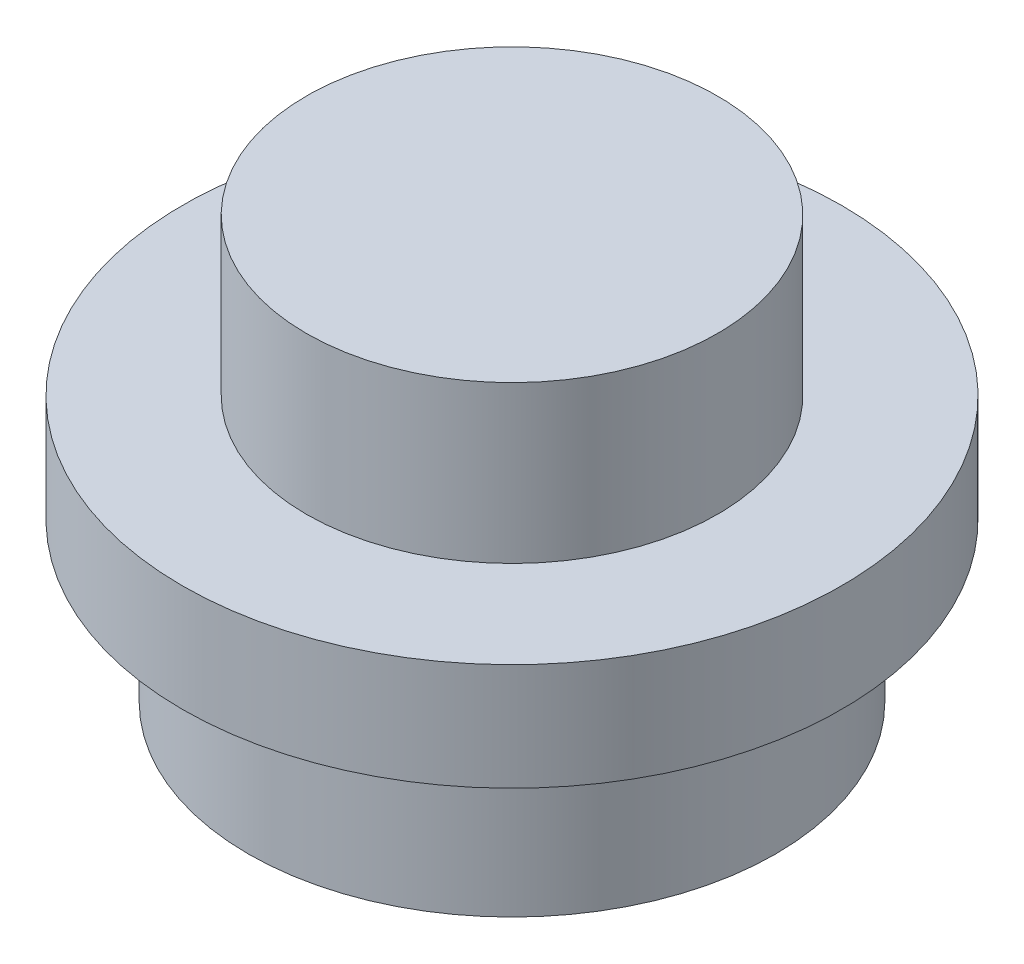
ISO-10303-21;
HEADER;
FILE_DESCRIPTION(('STEP AP214'),'2;1');
FILE_NAME('part.step','',(''),(''),'','','');
FILE_SCHEMA(('AUTOMOTIVE_DESIGN { 1 0 10303 214 1 1 1 1 }'));
ENDSEC;
DATA;
#1=APPLICATION_CONTEXT('core data for automotive mechanical design processes');
#2=APPLICATION_PROTOCOL_DEFINITION('international standard','automotive_design',2000,#1);
#3=PRODUCT_CONTEXT('',#1,'mechanical');
#4=PRODUCT('Part','Part','',(#3));
#5=PRODUCT_RELATED_PRODUCT_CATEGORY('part','',(#4));
#6=PRODUCT_DEFINITION_FORMATION('','',#4);
#7=PRODUCT_DEFINITION_CONTEXT('part definition',#1,'design');
#8=PRODUCT_DEFINITION('design','',#6,#7);
#9=PRODUCT_DEFINITION_SHAPE('','',#8);
#10=(LENGTH_UNIT() NAMED_UNIT(*) SI_UNIT(.MILLI.,.METRE.));
#11=(NAMED_UNIT(*) PLANE_ANGLE_UNIT() SI_UNIT($,.RADIAN.));
#12=(NAMED_UNIT(*) SI_UNIT($,.STERADIAN.) SOLID_ANGLE_UNIT());
#13=UNCERTAINTY_MEASURE_WITH_UNIT(LENGTH_MEASURE(1.E-05),#10,'distance_accuracy_value','');
#14=(GEOMETRIC_REPRESENTATION_CONTEXT(3) GLOBAL_UNCERTAINTY_ASSIGNED_CONTEXT((#13)) GLOBAL_UNIT_ASSIGNED_CONTEXT((#10,
#11,#12)) REPRESENTATION_CONTEXT('',''));
#15=CARTESIAN_POINT('',(0.,0.,0.));
#16=DIRECTION('',(0.,0.,1.));
#17=DIRECTION('',(1.,0.,0.));
#18=AXIS2_PLACEMENT_3D('',#15,#16,#17);
#19=CARTESIAN_POINT('',(-0.455886695767593,2.159,0.));
#20=DIRECTION('',(0.,-1.,0.));
#21=DIRECTION('',(0.,0.,-1.));
#22=AXIS2_PLACEMENT_3D('',#19,#20,#21);
#23=PLANE('',#22);
#24=CARTESIAN_POINT('',(-0.455886695767593,2.159,0.));
#25=DIRECTION('',(0.,1.,0.));
#26=DIRECTION('',(0.,0.,1.));
#27=AXIS2_PLACEMENT_3D('',#24,#25,#26);
#28=CIRCLE('',#27,2.38125);
#29=CARTESIAN_POINT('',(-0.455886695767593,2.159,2.38125));
#30=VERTEX_POINT('',#29);
#31=EDGE_CURVE('E10',#30,#30,#28,.T.);
#32=ORIENTED_EDGE('',*,*,#31,.F.);
#33=EDGE_LOOP('',(#32));
#34=FACE_BOUND('',#33,.T.);
#35=ADVANCED_FACE('F31',(#34),#23,.T.);
#36=CARTESIAN_POINT('',(-0.455886695767593,5.08,0.));
#37=DIRECTION('',(0.,1.,0.));
#38=DIRECTION('',(0.,0.,1.));
#39=AXIS2_PLACEMENT_3D('',#36,#37,#38);
#40=CYLINDRICAL_SURFACE('',#39,2.38125);
#41=ORIENTED_EDGE('',*,*,#31,.T.);
#42=EDGE_LOOP('',(#41));
#43=FACE_BOUND('',#42,.T.);
#44=CARTESIAN_POINT('',(-0.455886695767593,0.,0.));
#45=DIRECTION('',(0.,1.,0.));
#46=DIRECTION('',(0.,0.,1.));
#47=AXIS2_PLACEMENT_3D('',#44,#45,#46);
#48=CIRCLE('',#47,2.38125);
#49=CARTESIAN_POINT('',(-0.455886695767593,0.,2.38125));
#50=VERTEX_POINT('',#49);
#51=EDGE_CURVE('E37',#50,#50,#48,.T.);
#52=ORIENTED_EDGE('',*,*,#51,.F.);
#53=EDGE_LOOP('',(#52));
#54=FACE_BOUND('',#53,.T.);
#55=ADVANCED_FACE('F79',(#43,#54),#40,.F.);
#56=CARTESIAN_POINT('',(-2.83713669576759,0.,0.));
#57=DIRECTION('',(0.,-1.,0.));
#58=DIRECTION('',(0.,0.,-1.));
#59=AXIS2_PLACEMENT_3D('',#56,#57,#58);
#60=PLANE('',#59);
#61=ORIENTED_EDGE('',*,*,#51,.T.);
#62=EDGE_LOOP('',(#61));
#63=FACE_BOUND('',#62,.T.);
#64=CARTESIAN_POINT('',(-0.455886695767593,0.,0.));
#65=DIRECTION('',(0.,1.,0.));
#66=DIRECTION('',(0.,0.,1.));
#67=AXIS2_PLACEMENT_3D('',#64,#65,#66);
#68=CIRCLE('',#67,3.175);
#69=CARTESIAN_POINT('',(-0.455886695767593,0.,3.175));
#70=VERTEX_POINT('',#69);
#71=EDGE_CURVE('E41',#70,#70,#68,.T.);
#72=ORIENTED_EDGE('',*,*,#71,.F.);
#73=EDGE_LOOP('',(#72));
#74=FACE_BOUND('',#73,.T.);
#75=ADVANCED_FACE('F84',(#63,#74),#60,.T.);
#76=CARTESIAN_POINT('',(-0.455886695767593,5.08,0.));
#77=DIRECTION('',(0.,1.,0.));
#78=DIRECTION('',(0.,0.,1.));
#79=AXIS2_PLACEMENT_3D('',#76,#77,#78);
#80=CYLINDRICAL_SURFACE('',#79,3.175);
#81=ORIENTED_EDGE('',*,*,#71,.T.);
#82=EDGE_LOOP('',(#81));
#83=FACE_BOUND('',#82,.T.);
#84=CARTESIAN_POINT('',(-0.455886695767593,1.905,0.));
#85=DIRECTION('',(0.,1.,0.));
#86=DIRECTION('',(0.,0.,1.));
#87=AXIS2_PLACEMENT_3D('',#84,#85,#86);
#88=CIRCLE('',#87,3.175);
#89=CARTESIAN_POINT('',(-0.455886695767593,1.905,3.175));
#90=VERTEX_POINT('',#89);
#91=EDGE_CURVE('E45',#90,#90,#88,.T.);
#92=ORIENTED_EDGE('',*,*,#91,.F.);
#93=EDGE_LOOP('',(#92));
#94=FACE_BOUND('',#93,.T.);
#95=ADVANCED_FACE('F88',(#83,#94),#80,.T.);
#96=CARTESIAN_POINT('',(-3.63088669576759,1.905,0.));
#97=DIRECTION('',(0.,-1.,0.));
#98=DIRECTION('',(0.,0.,-1.));
#99=AXIS2_PLACEMENT_3D('',#96,#97,#98);
#100=PLANE('',#99);
#101=ORIENTED_EDGE('',*,*,#91,.T.);
#102=EDGE_LOOP('',(#101));
#103=FACE_BOUND('',#102,.T.);
#104=CARTESIAN_POINT('',(-0.455886695767593,1.905,0.));
#105=DIRECTION('',(0.,1.,0.));
#106=DIRECTION('',(0.,0.,1.));
#107=AXIS2_PLACEMENT_3D('',#104,#105,#106);
#108=CIRCLE('',#107,3.96875);
#109=CARTESIAN_POINT('',(-0.455886695767593,1.905,3.96875));
#110=VERTEX_POINT('',#109);
#111=EDGE_CURVE('E50',#110,#110,#108,.T.);
#112=ORIENTED_EDGE('',*,*,#111,.F.);
#113=EDGE_LOOP('',(#112));
#114=FACE_BOUND('',#113,.T.);
#115=ADVANCED_FACE('F94',(#103,#114),#100,.T.);
#116=CARTESIAN_POINT('',(-0.455886695767593,5.08,0.));
#117=DIRECTION('',(0.,1.,0.));
#118=DIRECTION('',(0.,0.,1.));
#119=AXIS2_PLACEMENT_3D('',#116,#117,#118);
#120=CYLINDRICAL_SURFACE('',#119,3.96875);
#121=ORIENTED_EDGE('',*,*,#111,.T.);
#122=EDGE_LOOP('',(#121));
#123=FACE_BOUND('',#122,.T.);
#124=CARTESIAN_POINT('',(-0.455886695767593,3.19374478298068,0.));
#125=DIRECTION('',(0.,1.,0.));
#126=DIRECTION('',(0.,0.,1.));
#127=AXIS2_PLACEMENT_3D('',#124,#125,#126);
#128=CIRCLE('',#127,3.96875);
#129=CARTESIAN_POINT('',(-0.455886695767593,3.19374478298068,3.96875));
#130=VERTEX_POINT('',#129);
#131=EDGE_CURVE('E53',#130,#130,#128,.T.);
#132=ORIENTED_EDGE('',*,*,#131,.F.);
#133=EDGE_LOOP('',(#132));
#134=FACE_BOUND('',#133,.T.);
#135=ADVANCED_FACE('F75',(#123,#134),#120,.T.);
#136=CARTESIAN_POINT('',(-4.42463669576759,3.19374478298068,0.));
#137=DIRECTION('',(0.,1.,0.));
#138=DIRECTION('',(0.,0.,1.));
#139=AXIS2_PLACEMENT_3D('',#136,#137,#138);
#140=PLANE('',#139);
#141=ORIENTED_EDGE('',*,*,#131,.T.);
#142=EDGE_LOOP('',(#141));
#143=FACE_BOUND('',#142,.T.);
#144=CARTESIAN_POINT('',(-0.455886695767593,3.19374478298068,0.));
#145=DIRECTION('',(0.,1.,0.));
#146=DIRECTION('',(0.,0.,1.));
#147=AXIS2_PLACEMENT_3D('',#144,#145,#146);
#148=CIRCLE('',#147,2.4765);
#149=CARTESIAN_POINT('',(-0.455886695767593,3.19374478298068,2.4765));
#150=VERTEX_POINT('',#149);
#151=EDGE_CURVE('E56',#150,#150,#148,.T.);
#152=ORIENTED_EDGE('',*,*,#151,.F.);
#153=EDGE_LOOP('',(#152));
#154=FACE_BOUND('',#153,.T.);
#155=ADVANCED_FACE('F67',(#143,#154),#140,.T.);
#156=CARTESIAN_POINT('',(-0.455886695767593,5.08,0.));
#157=DIRECTION('',(0.,1.,0.));
#158=DIRECTION('',(0.,0.,1.));
#159=AXIS2_PLACEMENT_3D('',#156,#157,#158);
#160=CYLINDRICAL_SURFACE('',#159,2.4765);
#161=ORIENTED_EDGE('',*,*,#151,.T.);
#162=EDGE_LOOP('',(#161));
#163=FACE_BOUND('',#162,.T.);
#164=CARTESIAN_POINT('',(-0.455886695767593,5.08,0.));
#165=DIRECTION('',(0.,1.,0.));
#166=DIRECTION('',(0.,0.,1.));
#167=AXIS2_PLACEMENT_3D('',#164,#165,#166);
#168=CIRCLE('',#167,2.4765);
#169=CARTESIAN_POINT('',(-0.455886695767593,5.08,2.4765));
#170=VERTEX_POINT('',#169);
#171=EDGE_CURVE('E59',#170,#170,#168,.T.);
#172=ORIENTED_EDGE('',*,*,#171,.F.);
#173=EDGE_LOOP('',(#172));
#174=FACE_BOUND('',#173,.T.);
#175=ADVANCED_FACE('F65',(#163,#174),#160,.T.);
#176=CARTESIAN_POINT('',(-2.93238669576759,5.08,0.));
#177=DIRECTION('',(0.,1.,0.));
#178=DIRECTION('',(0.,0.,1.));
#179=AXIS2_PLACEMENT_3D('',#176,#177,#178);
#180=PLANE('',#179);
#181=ORIENTED_EDGE('',*,*,#171,.T.);
#182=EDGE_LOOP('',(#181));
#183=FACE_BOUND('',#182,.T.);
#184=ADVANCED_FACE('F63',(#183),#180,.T.);
#185=CLOSED_SHELL('',(#35,#55,#75,#95,#115,#135,#155,#175,#184));
#186=MANIFOLD_SOLID_BREP('B2',#185);
#187=ADVANCED_BREP_SHAPE_REPRESENTATION('',(#18,#186),#14);
#188=SHAPE_DEFINITION_REPRESENTATION(#9,#187);
ENDSEC;
END-ISO-10303-21;
